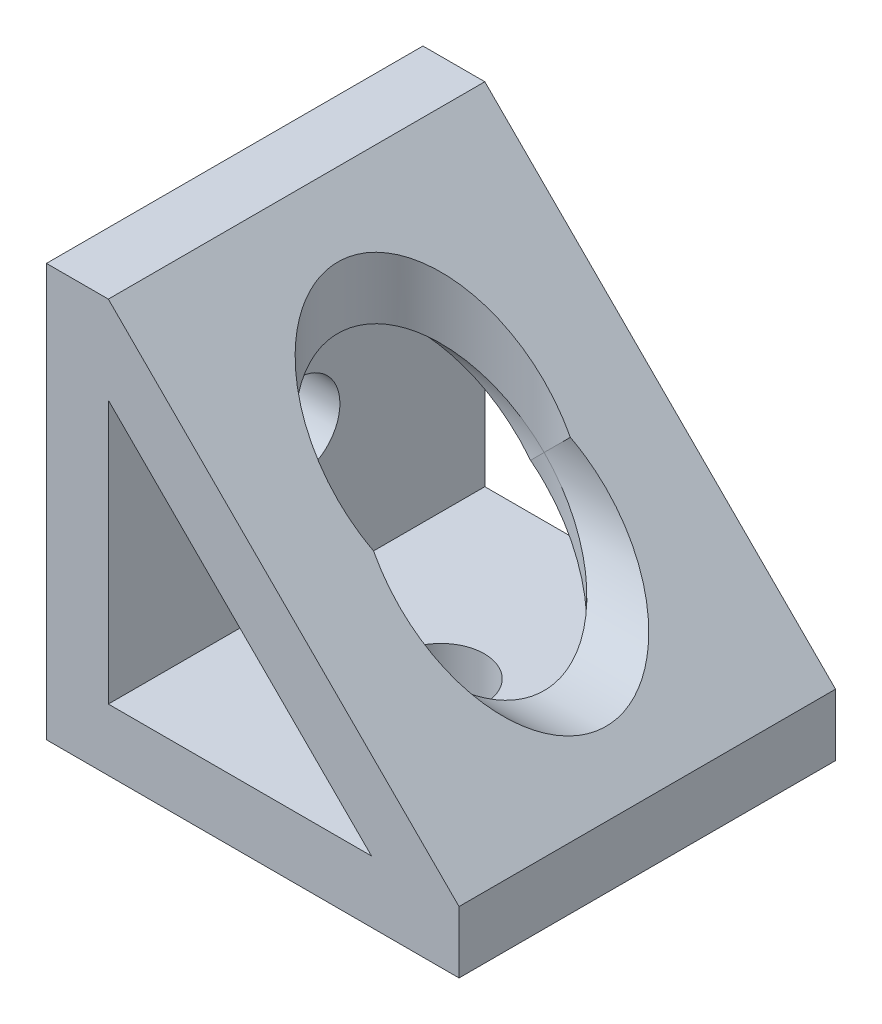
ISO-10303-21;
HEADER;
FILE_DESCRIPTION(('STEP AP214'),'2;1');
FILE_NAME('part.step','',(''),(''),'','','');
FILE_SCHEMA(('AUTOMOTIVE_DESIGN { 1 0 10303 214 1 1 1 1 }'));
ENDSEC;
DATA;
#1=APPLICATION_CONTEXT('core data for automotive mechanical design processes');
#2=APPLICATION_PROTOCOL_DEFINITION('international standard','automotive_design',2000,#1);
#3=PRODUCT_CONTEXT('',#1,'mechanical');
#4=PRODUCT('Part','Part','',(#3));
#5=PRODUCT_RELATED_PRODUCT_CATEGORY('part','',(#4));
#6=PRODUCT_DEFINITION_FORMATION('','',#4);
#7=PRODUCT_DEFINITION_CONTEXT('part definition',#1,'design');
#8=PRODUCT_DEFINITION('design','',#6,#7);
#9=PRODUCT_DEFINITION_SHAPE('','',#8);
#10=(LENGTH_UNIT() NAMED_UNIT(*) SI_UNIT(.MILLI.,.METRE.));
#11=(NAMED_UNIT(*) PLANE_ANGLE_UNIT() SI_UNIT($,.RADIAN.));
#12=(NAMED_UNIT(*) SI_UNIT($,.STERADIAN.) SOLID_ANGLE_UNIT());
#13=UNCERTAINTY_MEASURE_WITH_UNIT(LENGTH_MEASURE(1.E-05),#10,'distance_accuracy_value','');
#14=(GEOMETRIC_REPRESENTATION_CONTEXT(3) GLOBAL_UNCERTAINTY_ASSIGNED_CONTEXT((#13)) GLOBAL_UNIT_ASSIGNED_CONTEXT((#10,
#11,#12)) REPRESENTATION_CONTEXT('',''));
#15=CARTESIAN_POINT('',(0.,0.,0.));
#16=DIRECTION('',(0.,0.,1.));
#17=DIRECTION('',(1.,0.,0.));
#18=AXIS2_PLACEMENT_3D('',#15,#16,#17);
#19=CARTESIAN_POINT('',(0.,20.,0.));
#20=DIRECTION('',(0.,-1.,0.));
#21=DIRECTION('',(0.,0.,-1.));
#22=AXIS2_PLACEMENT_3D('',#19,#20,#21);
#23=CYLINDRICAL_SURFACE('',#22,10.);
#24=CARTESIAN_POINT('',(0.,0.,0.));
#25=DIRECTION('',(-0.707106781186548,-0.707106781186547,0.));
#26=DIRECTION('',(0.707106781186547,-0.707106781186548,0.));
#27=AXIS2_PLACEMENT_3D('',#24,#25,#26);
#28=ELLIPSE('',#27,14.1421356237309,10.);
#29=CARTESIAN_POINT('',(0.,0.,-10.));
#30=VERTEX_POINT('',#29);
#31=CARTESIAN_POINT('',(0.,0.,10.));
#32=VERTEX_POINT('',#31);
#33=EDGE_CURVE('E11',#30,#32,#28,.F.);
#34=ORIENTED_EDGE('',*,*,#33,.F.);
#35=CARTESIAN_POINT('',(0.,0.,0.));
#36=DIRECTION('',(0.707106781186547,-0.707106781186548,0.));
#37=DIRECTION('',(-0.707106781186548,-0.707106781186547,0.));
#38=AXIS2_PLACEMENT_3D('',#35,#36,#37);
#39=ELLIPSE('',#38,14.1421356237309,10.);
#40=CARTESIAN_POINT('',(3.,3.,-9.53939201416945));
#41=VERTEX_POINT('',#40);
#42=EDGE_CURVE('E149',#41,#30,#39,.F.);
#43=ORIENTED_EDGE('',*,*,#42,.F.);
#44=CARTESIAN_POINT('',(0.,6.,0.));
#45=DIRECTION('',(0.707106781186548,0.707106781186548,0.));
#46=DIRECTION('',(0.707106781186548,-0.707106781186548,0.));
#47=AXIS2_PLACEMENT_3D('',#44,#45,#46);
#48=ELLIPSE('',#47,14.1421356237309,10.);
#49=CARTESIAN_POINT('',(3.00000000000001,2.99999999999998,9.53939201416945));
#50=VERTEX_POINT('',#49);
#51=EDGE_CURVE('E262',#50,#41,#48,.F.);
#52=ORIENTED_EDGE('',*,*,#51,.F.);
#53=EDGE_CURVE('E148',#32,#50,#39,.F.);
#54=ORIENTED_EDGE('',*,*,#53,.F.);
#55=EDGE_LOOP('',(#34,#43,#52,#54));
#56=FACE_BOUND('',#55,.T.);
#57=ADVANCED_FACE('F38',(#56),#23,.F.);
#58=CARTESIAN_POINT('',(-14.,20.,-18.25));
#59=DIRECTION('',(0.,1.,0.));
#60=DIRECTION('',(0.,0.,1.));
#61=AXIS2_PLACEMENT_3D('',#58,#59,#60);
#62=PLANE('',#61);
#63=DIRECTION('',(0.,0.,1.));
#64=VECTOR('',#63,1.);
#65=CARTESIAN_POINT('',(-20.,20.,-18.25));
#66=LINE('',#65,#64);
#67=CARTESIAN_POINT('',(-20.,20.,-18.25));
#68=VERTEX_POINT('',#67);
#69=CARTESIAN_POINT('',(-20.,20.,18.25));
#70=VERTEX_POINT('',#69);
#71=EDGE_CURVE('E169',#68,#70,#66,.T.);
#72=ORIENTED_EDGE('',*,*,#71,.T.);
#73=DIRECTION('',(-1.,0.,0.));
#74=VECTOR('',#73,1.);
#75=CARTESIAN_POINT('',(-14.,20.,18.25));
#76=LINE('',#75,#74);
#77=CARTESIAN_POINT('',(-14.,20.,18.25));
#78=VERTEX_POINT('',#77);
#79=EDGE_CURVE('E238',#78,#70,#76,.T.);
#80=ORIENTED_EDGE('',*,*,#79,.F.);
#81=DIRECTION('',(0.,0.,1.));
#82=VECTOR('',#81,1.);
#83=CARTESIAN_POINT('',(-14.,20.,-18.25));
#84=LINE('',#83,#82);
#85=CARTESIAN_POINT('',(-14.,20.,-18.25));
#86=VERTEX_POINT('',#85);
#87=EDGE_CURVE('E160',#86,#78,#84,.T.);
#88=ORIENTED_EDGE('',*,*,#87,.F.);
#89=DIRECTION('',(-1.,0.,0.));
#90=VECTOR('',#89,1.);
#91=CARTESIAN_POINT('',(-14.,20.,-18.25));
#92=LINE('',#91,#90);
#93=EDGE_CURVE('E197',#86,#68,#92,.T.);
#94=ORIENTED_EDGE('',*,*,#93,.T.);
#95=EDGE_LOOP('',(#72,#80,#88,#94));
#96=FACE_BOUND('',#95,.T.);
#97=ADVANCED_FACE('F40',(#96),#62,.T.);
#98=CARTESIAN_POINT('',(20.,-14.,-18.25));
#99=DIRECTION('',(0.707106781186548,0.707106781186548,0.));
#100=DIRECTION('',(-0.707106781186548,0.707106781186548,0.));
#101=AXIS2_PLACEMENT_3D('',#98,#99,#100);
#102=PLANE('',#101);
#103=CARTESIAN_POINT('',(6.,0.,0.));
#104=DIRECTION('',(0.707106781186548,0.707106781186548,0.));
#105=DIRECTION('',(-0.707106781186548,0.707106781186548,0.));
#106=AXIS2_PLACEMENT_3D('',#103,#104,#105);
#107=ELLIPSE('',#106,14.1421356237309,10.);
#108=EDGE_CURVE('E155',#50,#41,#107,.T.);
#109=ORIENTED_EDGE('',*,*,#108,.F.);
#110=ORIENTED_EDGE('',*,*,#51,.T.);
#111=EDGE_LOOP('',(#109,#110));
#112=FACE_BOUND('',#111,.T.);
#113=ORIENTED_EDGE('',*,*,#87,.T.);
#114=DIRECTION('',(-0.707106781186547,0.707106781186547,0.));
#115=VECTOR('',#114,1.);
#116=CARTESIAN_POINT('',(20.,-14.,18.25));
#117=LINE('',#116,#115);
#118=CARTESIAN_POINT('',(20.,-14.,18.25));
#119=VERTEX_POINT('',#118);
#120=EDGE_CURVE('E222',#119,#78,#117,.T.);
#121=ORIENTED_EDGE('',*,*,#120,.F.);
#122=DIRECTION('',(0.,0.,1.));
#123=VECTOR('',#122,1.);
#124=CARTESIAN_POINT('',(20.,-14.,-18.25));
#125=LINE('',#124,#123);
#126=CARTESIAN_POINT('',(20.,-14.,-18.25));
#127=VERTEX_POINT('',#126);
#128=EDGE_CURVE('E178',#127,#119,#125,.T.);
#129=ORIENTED_EDGE('',*,*,#128,.F.);
#130=DIRECTION('',(-0.707106781186547,0.707106781186547,0.));
#131=VECTOR('',#130,1.);
#132=CARTESIAN_POINT('',(20.,-14.,-18.25));
#133=LINE('',#132,#131);
#134=EDGE_CURVE('E173',#127,#86,#133,.T.);
#135=ORIENTED_EDGE('',*,*,#134,.T.);
#136=EDGE_LOOP('',(#113,#121,#129,#135));
#137=FACE_BOUND('',#136,.T.);
#138=ADVANCED_FACE('F311',(#112,#137),#102,.T.);
#139=CARTESIAN_POINT('',(20.,-20.,-18.25));
#140=DIRECTION('',(1.,0.,0.));
#141=DIRECTION('',(0.,0.,-1.));
#142=AXIS2_PLACEMENT_3D('',#139,#140,#141);
#143=PLANE('',#142);
#144=ORIENTED_EDGE('',*,*,#128,.T.);
#145=DIRECTION('',(0.,1.,0.));
#146=VECTOR('',#145,1.);
#147=CARTESIAN_POINT('',(20.,-20.,18.25));
#148=LINE('',#147,#146);
#149=CARTESIAN_POINT('',(20.,-20.,18.25));
#150=VERTEX_POINT('',#149);
#151=EDGE_CURVE('E226',#150,#119,#148,.T.);
#152=ORIENTED_EDGE('',*,*,#151,.F.);
#153=DIRECTION('',(0.,0.,1.));
#154=VECTOR('',#153,1.);
#155=CARTESIAN_POINT('',(20.,-20.,-18.25));
#156=LINE('',#155,#154);
#157=CARTESIAN_POINT('',(20.,-20.,-18.25));
#158=VERTEX_POINT('',#157);
#159=EDGE_CURVE('E176',#158,#150,#156,.T.);
#160=ORIENTED_EDGE('',*,*,#159,.F.);
#161=DIRECTION('',(0.,1.,0.));
#162=VECTOR('',#161,1.);
#163=CARTESIAN_POINT('',(20.,-20.,-18.25));
#164=LINE('',#163,#162);
#165=EDGE_CURVE('E186',#158,#127,#164,.T.);
#166=ORIENTED_EDGE('',*,*,#165,.T.);
#167=EDGE_LOOP('',(#144,#152,#160,#166));
#168=FACE_BOUND('',#167,.T.);
#169=ADVANCED_FACE('F315',(#168),#143,.T.);
#170=CARTESIAN_POINT('',(-20.,-20.,-18.25));
#171=DIRECTION('',(0.,-1.,0.));
#172=DIRECTION('',(0.,0.,-1.));
#173=AXIS2_PLACEMENT_3D('',#170,#171,#172);
#174=PLANE('',#173);
#175=CARTESIAN_POINT('',(0.,-20.,0.));
#176=DIRECTION('',(0.,-1.,0.));
#177=DIRECTION('',(0.,0.,-1.));
#178=AXIS2_PLACEMENT_3D('',#175,#176,#177);
#179=CIRCLE('',#178,4.2);
#180=CARTESIAN_POINT('',(0.,-20.,-4.2));
#181=VERTEX_POINT('',#180);
#182=EDGE_CURVE('E254',#181,#181,#179,.T.);
#183=ORIENTED_EDGE('',*,*,#182,.F.);
#184=EDGE_LOOP('',(#183));
#185=FACE_BOUND('',#184,.T.);
#186=ORIENTED_EDGE('',*,*,#159,.T.);
#187=DIRECTION('',(1.,0.,0.));
#188=VECTOR('',#187,1.);
#189=CARTESIAN_POINT('',(-20.,-20.,18.25));
#190=LINE('',#189,#188);
#191=CARTESIAN_POINT('',(-20.,-20.,18.25));
#192=VERTEX_POINT('',#191);
#193=EDGE_CURVE('E230',#192,#150,#190,.T.);
#194=ORIENTED_EDGE('',*,*,#193,.F.);
#195=DIRECTION('',(0.,0.,1.));
#196=VECTOR('',#195,1.);
#197=CARTESIAN_POINT('',(-20.,-20.,-18.25));
#198=LINE('',#197,#196);
#199=CARTESIAN_POINT('',(-20.,-20.,-18.25));
#200=VERTEX_POINT('',#199);
#201=EDGE_CURVE('E172',#200,#192,#198,.T.);
#202=ORIENTED_EDGE('',*,*,#201,.F.);
#203=DIRECTION('',(1.,0.,0.));
#204=VECTOR('',#203,1.);
#205=CARTESIAN_POINT('',(-20.,-20.,-18.25));
#206=LINE('',#205,#204);
#207=EDGE_CURVE('E189',#200,#158,#206,.T.);
#208=ORIENTED_EDGE('',*,*,#207,.T.);
#209=EDGE_LOOP('',(#186,#194,#202,#208));
#210=FACE_BOUND('',#209,.T.);
#211=ADVANCED_FACE('F317',(#185,#210),#174,.T.);
#212=CARTESIAN_POINT('',(-20.,20.,-18.25));
#213=DIRECTION('',(-1.,0.,0.));
#214=DIRECTION('',(0.,-1.,0.));
#215=AXIS2_PLACEMENT_3D('',#212,#213,#214);
#216=PLANE('',#215);
#217=CARTESIAN_POINT('',(-20.,0.,0.));
#218=DIRECTION('',(1.,0.,0.));
#219=DIRECTION('',(0.,0.,-1.));
#220=AXIS2_PLACEMENT_3D('',#217,#218,#219);
#221=CIRCLE('',#220,4.2);
#222=CARTESIAN_POINT('',(-20.,0.,-4.2));
#223=VERTEX_POINT('',#222);
#224=EDGE_CURVE('E269',#223,#223,#221,.T.);
#225=ORIENTED_EDGE('',*,*,#224,.T.);
#226=EDGE_LOOP('',(#225));
#227=FACE_BOUND('',#226,.T.);
#228=ORIENTED_EDGE('',*,*,#201,.T.);
#229=DIRECTION('',(0.,-1.,0.));
#230=VECTOR('',#229,1.);
#231=CARTESIAN_POINT('',(-20.,20.,18.25));
#232=LINE('',#231,#230);
#233=EDGE_CURVE('E234',#70,#192,#232,.T.);
#234=ORIENTED_EDGE('',*,*,#233,.F.);
#235=ORIENTED_EDGE('',*,*,#71,.F.);
#236=DIRECTION('',(0.,-1.,0.));
#237=VECTOR('',#236,1.);
#238=CARTESIAN_POINT('',(-20.,20.,-18.25));
#239=LINE('',#238,#237);
#240=EDGE_CURVE('E193',#68,#200,#239,.T.);
#241=ORIENTED_EDGE('',*,*,#240,.T.);
#242=EDGE_LOOP('',(#228,#234,#235,#241));
#243=FACE_BOUND('',#242,.T.);
#244=ADVANCED_FACE('F302',(#227,#243),#216,.T.);
#245=CARTESIAN_POINT('',(0.,0.,-18.25));
#246=DIRECTION('',(0.,0.,1.));
#247=DIRECTION('',(1.,0.,0.));
#248=AXIS2_PLACEMENT_3D('',#245,#246,#247);
#249=PLANE('',#248);
#250=DIRECTION('',(1.,0.,0.));
#251=VECTOR('',#250,1.);
#252=CARTESIAN_POINT('',(-14.,-14.,-18.25));
#253=LINE('',#252,#251);
#254=CARTESIAN_POINT('',(-14.,-14.,-18.25));
#255=VERTEX_POINT('',#254);
#256=CARTESIAN_POINT('',(11.5147186257614,-14.,-18.25));
#257=VERTEX_POINT('',#256);
#258=EDGE_CURVE('E206',#255,#257,#253,.T.);
#259=ORIENTED_EDGE('',*,*,#258,.T.);
#260=DIRECTION('',(-0.707106781186547,0.707106781186548,0.));
#261=VECTOR('',#260,1.);
#262=CARTESIAN_POINT('',(11.5147186257614,-14.,-18.25));
#263=LINE('',#262,#261);
#264=CARTESIAN_POINT('',(-14.,11.5147186257614,-18.25));
#265=VERTEX_POINT('',#264);
#266=EDGE_CURVE('E218',#257,#265,#263,.T.);
#267=ORIENTED_EDGE('',*,*,#266,.T.);
#268=DIRECTION('',(0.,-1.,0.));
#269=VECTOR('',#268,1.);
#270=CARTESIAN_POINT('',(-14.,11.5147186257614,-18.25));
#271=LINE('',#270,#269);
#272=EDGE_CURVE('E214',#265,#255,#271,.T.);
#273=ORIENTED_EDGE('',*,*,#272,.T.);
#274=EDGE_LOOP('',(#259,#267,#273));
#275=FACE_BOUND('',#274,.T.);
#276=ORIENTED_EDGE('',*,*,#93,.F.);
#277=ORIENTED_EDGE('',*,*,#134,.F.);
#278=ORIENTED_EDGE('',*,*,#165,.F.);
#279=ORIENTED_EDGE('',*,*,#207,.F.);
#280=ORIENTED_EDGE('',*,*,#240,.F.);
#281=EDGE_LOOP('',(#276,#277,#278,#279,#280));
#282=FACE_BOUND('',#281,.T.);
#283=ADVANCED_FACE('F284',(#275,#282),#249,.F.);
#284=CARTESIAN_POINT('',(11.5147186257614,-14.,-18.25));
#285=DIRECTION('',(0.707106781186548,0.707106781186547,0.));
#286=DIRECTION('',(-0.707106781186547,0.707106781186548,0.));
#287=AXIS2_PLACEMENT_3D('',#284,#285,#286);
#288=PLANE('',#287);
#289=CARTESIAN_POINT('',(0.,-2.48528137423857,0.));
#290=DIRECTION('',(0.707106781186548,0.707106781186547,0.));
#291=DIRECTION('',(0.707106781186547,-0.707106781186548,0.));
#292=AXIS2_PLACEMENT_3D('',#289,#290,#291);
#293=ELLIPSE('',#292,14.1421356237309,10.);
#294=CARTESIAN_POINT('',(-1.24264068711928,-1.24264068711928,-9.92249183031741));
#295=VERTEX_POINT('',#294);
#296=CARTESIAN_POINT('',(-1.24264068711911,-1.24264068711945,9.92249183031741));
#297=VERTEX_POINT('',#296);
#298=EDGE_CURVE('E265',#295,#297,#293,.F.);
#299=ORIENTED_EDGE('',*,*,#298,.F.);
#300=CARTESIAN_POINT('',(-2.48528137423857,0.,0.));
#301=DIRECTION('',(0.707106781186548,0.707106781186547,0.));
#302=DIRECTION('',(-0.707106781186547,0.707106781186548,0.));
#303=AXIS2_PLACEMENT_3D('',#300,#301,#302);
#304=ELLIPSE('',#303,14.1421356237309,10.);
#305=EDGE_CURVE('E66',#295,#297,#304,.T.);
#306=ORIENTED_EDGE('',*,*,#305,.T.);
#307=EDGE_LOOP('',(#299,#306));
#308=FACE_BOUND('',#307,.T.);
#309=DIRECTION('',(0.,0.,1.));
#310=VECTOR('',#309,1.);
#311=CARTESIAN_POINT('',(11.5147186257614,-14.,-18.25));
#312=LINE('',#311,#310);
#313=CARTESIAN_POINT('',(11.5147186257614,-14.,18.25));
#314=VERTEX_POINT('',#313);
#315=EDGE_CURVE('E201',#257,#314,#312,.T.);
#316=ORIENTED_EDGE('',*,*,#315,.T.);
#317=DIRECTION('',(-0.707106781186547,0.707106781186548,0.));
#318=VECTOR('',#317,1.);
#319=CARTESIAN_POINT('',(11.5147186257614,-14.,18.25));
#320=LINE('',#319,#318);
#321=CARTESIAN_POINT('',(-14.,11.5147186257614,18.25));
#322=VERTEX_POINT('',#321);
#323=EDGE_CURVE('E250',#314,#322,#320,.T.);
#324=ORIENTED_EDGE('',*,*,#323,.T.);
#325=DIRECTION('',(0.,0.,1.));
#326=VECTOR('',#325,1.);
#327=CARTESIAN_POINT('',(-14.,11.5147186257614,-18.25));
#328=LINE('',#327,#326);
#329=EDGE_CURVE('E202',#265,#322,#328,.T.);
#330=ORIENTED_EDGE('',*,*,#329,.F.);
#331=ORIENTED_EDGE('',*,*,#266,.F.);
#332=EDGE_LOOP('',(#316,#324,#330,#331));
#333=FACE_BOUND('',#332,.T.);
#334=ADVANCED_FACE('F280',(#308,#333),#288,.F.);
#335=CARTESIAN_POINT('',(-14.,-14.,-18.25));
#336=DIRECTION('',(0.,-1.,0.));
#337=DIRECTION('',(0.,0.,-1.));
#338=AXIS2_PLACEMENT_3D('',#335,#336,#337);
#339=PLANE('',#338);
#340=DIRECTION('',(0.,0.,1.));
#341=VECTOR('',#340,1.);
#342=CARTESIAN_POINT('',(-14.,-14.,-18.25));
#343=LINE('',#342,#341);
#344=CARTESIAN_POINT('',(-14.,-14.,18.25));
#345=VERTEX_POINT('',#344);
#346=EDGE_CURVE('E205',#255,#345,#343,.T.);
#347=ORIENTED_EDGE('',*,*,#346,.T.);
#348=DIRECTION('',(1.,0.,0.));
#349=VECTOR('',#348,1.);
#350=CARTESIAN_POINT('',(-14.,-14.,18.25));
#351=LINE('',#350,#349);
#352=EDGE_CURVE('E242',#345,#314,#351,.T.);
#353=ORIENTED_EDGE('',*,*,#352,.T.);
#354=ORIENTED_EDGE('',*,*,#315,.F.);
#355=ORIENTED_EDGE('',*,*,#258,.F.);
#356=EDGE_LOOP('',(#347,#353,#354,#355));
#357=FACE_BOUND('',#356,.T.);
#358=CARTESIAN_POINT('',(0.,-14.,0.));
#359=DIRECTION('',(0.,-1.,0.));
#360=DIRECTION('',(0.,0.,-1.));
#361=AXIS2_PLACEMENT_3D('',#358,#359,#360);
#362=CIRCLE('',#361,4.2);
#363=CARTESIAN_POINT('',(0.,-14.,-4.2));
#364=VERTEX_POINT('',#363);
#365=EDGE_CURVE('E258',#364,#364,#362,.F.);
#366=ORIENTED_EDGE('',*,*,#365,.F.);
#367=EDGE_LOOP('',(#366));
#368=FACE_BOUND('',#367,.T.);
#369=ADVANCED_FACE('F283',(#357,#368),#339,.F.);
#370=CARTESIAN_POINT('',(-14.,11.5147186257614,-18.25));
#371=DIRECTION('',(-1.,0.,0.));
#372=DIRECTION('',(0.,-1.,0.));
#373=AXIS2_PLACEMENT_3D('',#370,#371,#372);
#374=PLANE('',#373);
#375=ORIENTED_EDGE('',*,*,#329,.T.);
#376=DIRECTION('',(0.,-1.,0.));
#377=VECTOR('',#376,1.);
#378=CARTESIAN_POINT('',(-14.,11.5147186257614,18.25));
#379=LINE('',#378,#377);
#380=EDGE_CURVE('E246',#322,#345,#379,.T.);
#381=ORIENTED_EDGE('',*,*,#380,.T.);
#382=ORIENTED_EDGE('',*,*,#346,.F.);
#383=ORIENTED_EDGE('',*,*,#272,.F.);
#384=EDGE_LOOP('',(#375,#381,#382,#383));
#385=FACE_BOUND('',#384,.T.);
#386=CARTESIAN_POINT('',(-14.,0.,0.));
#387=DIRECTION('',(-1.,0.,0.));
#388=DIRECTION('',(0.,-1.,0.));
#389=AXIS2_PLACEMENT_3D('',#386,#387,#388);
#390=CIRCLE('',#389,4.2);
#391=CARTESIAN_POINT('',(-14.,-4.2,0.));
#392=VERTEX_POINT('',#391);
#393=EDGE_CURVE('E268',#392,#392,#390,.T.);
#394=ORIENTED_EDGE('',*,*,#393,.T.);
#395=EDGE_LOOP('',(#394));
#396=FACE_BOUND('',#395,.T.);
#397=ADVANCED_FACE('F296',(#385,#396),#374,.F.);
#398=CARTESIAN_POINT('',(0.,0.,18.25));
#399=DIRECTION('',(0.,0.,1.));
#400=DIRECTION('',(1.,0.,0.));
#401=AXIS2_PLACEMENT_3D('',#398,#399,#400);
#402=PLANE('',#401);
#403=ORIENTED_EDGE('',*,*,#79,.T.);
#404=ORIENTED_EDGE('',*,*,#233,.T.);
#405=ORIENTED_EDGE('',*,*,#193,.T.);
#406=ORIENTED_EDGE('',*,*,#151,.T.);
#407=ORIENTED_EDGE('',*,*,#120,.T.);
#408=EDGE_LOOP('',(#403,#404,#405,#406,#407));
#409=FACE_BOUND('',#408,.T.);
#410=ORIENTED_EDGE('',*,*,#380,.F.);
#411=ORIENTED_EDGE('',*,*,#323,.F.);
#412=ORIENTED_EDGE('',*,*,#352,.F.);
#413=EDGE_LOOP('',(#410,#411,#412));
#414=FACE_BOUND('',#413,.T.);
#415=ADVANCED_FACE('F294',(#409,#414),#402,.T.);
#416=CARTESIAN_POINT('',(0.,20.001,0.));
#417=DIRECTION('',(0.,-1.,0.));
#418=DIRECTION('',(0.,0.,-1.));
#419=AXIS2_PLACEMENT_3D('',#416,#417,#418);
#420=CYLINDRICAL_SURFACE('',#419,4.2);
#421=ORIENTED_EDGE('',*,*,#182,.T.);
#422=EDGE_LOOP('',(#421));
#423=FACE_BOUND('',#422,.T.);
#424=ORIENTED_EDGE('',*,*,#365,.T.);
#425=EDGE_LOOP('',(#424));
#426=FACE_BOUND('',#425,.T.);
#427=ADVANCED_FACE('F337',(#423,#426),#420,.F.);
#428=CARTESIAN_POINT('',(0.,0.,0.));
#429=DIRECTION('',(-0.707106781186548,-0.707106781186547,0.));
#430=DIRECTION('',(0.707106781186547,-0.707106781186548,0.));
#431=AXIS2_PLACEMENT_3D('',#428,#429,#430);
#432=ELLIPSE('',#431,14.1421356237309,10.);
#433=EDGE_CURVE('E47',#30,#32,#432,.T.);
#434=ORIENTED_EDGE('',*,*,#433,.F.);
#435=CARTESIAN_POINT('',(0.,0.,0.));
#436=DIRECTION('',(0.707106781186547,-0.707106781186548,0.));
#437=DIRECTION('',(-0.707106781186548,-0.707106781186547,0.));
#438=AXIS2_PLACEMENT_3D('',#435,#436,#437);
#439=ELLIPSE('',#438,14.1421356237309,10.);
#440=EDGE_CURVE('E140',#295,#30,#439,.T.);
#441=ORIENTED_EDGE('',*,*,#440,.F.);
#442=ORIENTED_EDGE('',*,*,#298,.T.);
#443=EDGE_CURVE('E151',#32,#297,#439,.T.);
#444=ORIENTED_EDGE('',*,*,#443,.F.);
#445=EDGE_LOOP('',(#434,#441,#442,#444));
#446=FACE_BOUND('',#445,.T.);
#447=ADVANCED_FACE('F163',(#446),#23,.F.);
#448=CARTESIAN_POINT('',(20.001,0.,0.));
#449=DIRECTION('',(-1.,0.,0.));
#450=DIRECTION('',(0.,-1.,0.));
#451=AXIS2_PLACEMENT_3D('',#448,#449,#450);
#452=CYLINDRICAL_SURFACE('',#451,4.2);
#453=ORIENTED_EDGE('',*,*,#224,.F.);
#454=EDGE_LOOP('',(#453));
#455=FACE_BOUND('',#454,.T.);
#456=ORIENTED_EDGE('',*,*,#393,.F.);
#457=EDGE_LOOP('',(#456));
#458=FACE_BOUND('',#457,.T.);
#459=ADVANCED_FACE('F336',(#455,#458),#452,.F.);
#460=CARTESIAN_POINT('',(20.,0.,0.));
#461=DIRECTION('',(-1.,0.,0.));
#462=DIRECTION('',(0.,-1.,0.));
#463=AXIS2_PLACEMENT_3D('',#460,#461,#462);
#464=CYLINDRICAL_SURFACE('',#463,10.);
#465=ORIENTED_EDGE('',*,*,#433,.T.);
#466=ORIENTED_EDGE('',*,*,#53,.T.);
#467=ORIENTED_EDGE('',*,*,#108,.T.);
#468=ORIENTED_EDGE('',*,*,#42,.T.);
#469=EDGE_LOOP('',(#465,#466,#467,#468));
#470=FACE_BOUND('',#469,.T.);
#471=ADVANCED_FACE('F153',(#470),#464,.F.);
#472=ORIENTED_EDGE('',*,*,#33,.T.);
#473=ORIENTED_EDGE('',*,*,#443,.T.);
#474=ORIENTED_EDGE('',*,*,#305,.F.);
#475=ORIENTED_EDGE('',*,*,#440,.T.);
#476=EDGE_LOOP('',(#472,#473,#474,#475));
#477=FACE_BOUND('',#476,.T.);
#478=ADVANCED_FACE('F141',(#477),#464,.F.);
#479=CLOSED_SHELL('',(#57,#97,#138,#169,#211,#244,#283,#334,#369,#397,#415,#427,#447,#459,#471,#478));
#480=MANIFOLD_SOLID_BREP('B2',#479);
#481=ADVANCED_BREP_SHAPE_REPRESENTATION('',(#18,#480),#14);
#482=SHAPE_DEFINITION_REPRESENTATION(#9,#481);
ENDSEC;
END-ISO-10303-21;
